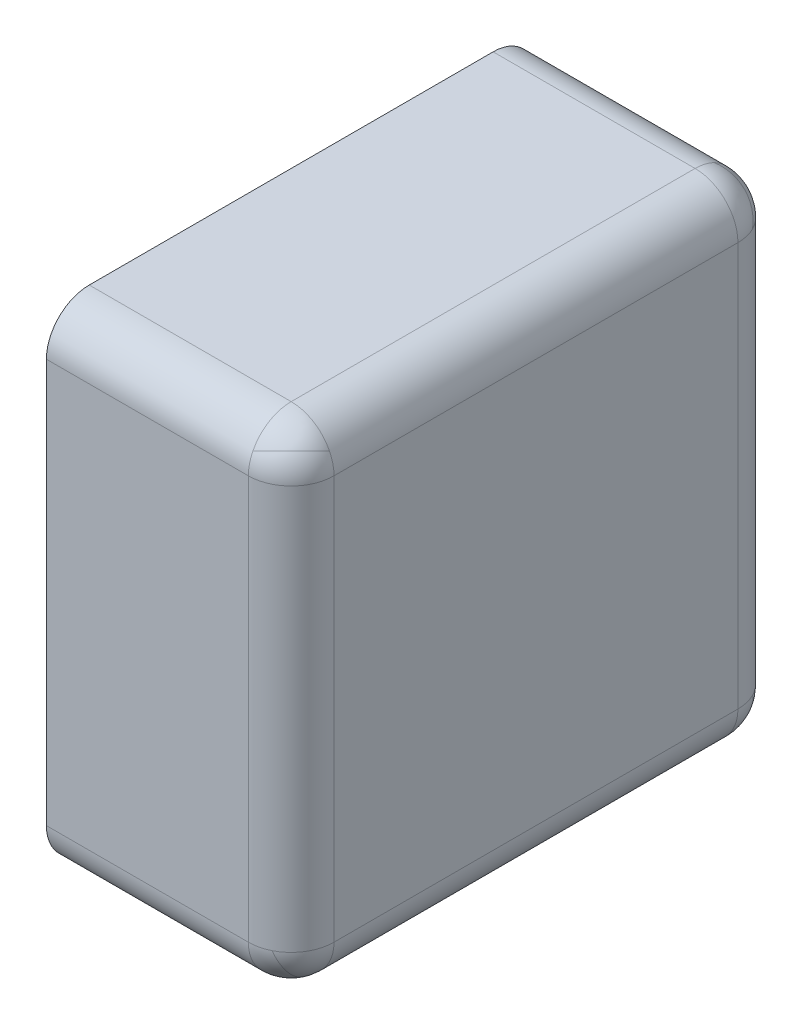
ISO-10303-21;
HEADER;
FILE_DESCRIPTION(('STEP AP214'),'2;1');
FILE_NAME('part.step','',(''),(''),'','','');
FILE_SCHEMA(('AUTOMOTIVE_DESIGN { 1 0 10303 214 1 1 1 1 }'));
ENDSEC;
DATA;
#1=APPLICATION_CONTEXT('core data for automotive mechanical design processes');
#2=APPLICATION_PROTOCOL_DEFINITION('international standard','automotive_design',2000,#1);
#3=PRODUCT_CONTEXT('',#1,'mechanical');
#4=PRODUCT('Part','Part','',(#3));
#5=PRODUCT_RELATED_PRODUCT_CATEGORY('part','',(#4));
#6=PRODUCT_DEFINITION_FORMATION('','',#4);
#7=PRODUCT_DEFINITION_CONTEXT('part definition',#1,'design');
#8=PRODUCT_DEFINITION('design','',#6,#7);
#9=PRODUCT_DEFINITION_SHAPE('','',#8);
#10=(LENGTH_UNIT() NAMED_UNIT(*) SI_UNIT(.MILLI.,.METRE.));
#11=(NAMED_UNIT(*) PLANE_ANGLE_UNIT() SI_UNIT($,.RADIAN.));
#12=(NAMED_UNIT(*) SI_UNIT($,.STERADIAN.) SOLID_ANGLE_UNIT());
#13=UNCERTAINTY_MEASURE_WITH_UNIT(LENGTH_MEASURE(1.E-05),#10,'distance_accuracy_value','');
#14=(GEOMETRIC_REPRESENTATION_CONTEXT(3) GLOBAL_UNCERTAINTY_ASSIGNED_CONTEXT((#13)) GLOBAL_UNIT_ASSIGNED_CONTEXT((#10,
#11,#12)) REPRESENTATION_CONTEXT('',''));
#15=CARTESIAN_POINT('',(0.,0.,0.));
#16=DIRECTION('',(0.,0.,1.));
#17=DIRECTION('',(1.,0.,0.));
#18=AXIS2_PLACEMENT_3D('',#15,#16,#17);
#19=CARTESIAN_POINT('',(0.770414518843274,0.370414518843274,0.0295854811567261));
#20=CARTESIAN_POINT('',(0.770414518843274,0.370414518843274,0.029585481156726));
#21=CARTESIAN_POINT('',(0.770414518843274,0.370414518843274,0.0295854811567262));
#22=CARTESIAN_POINT('',(0.770414518843274,0.370414518843274,0.0295854811567262));
#23=CARTESIAN_POINT('',(0.753915602470369,0.386913435216178,0.029585481156726));
#24=CARTESIAN_POINT('',(0.772966910088836,0.405964742834646,0.0676880963936607));
#25=CARTESIAN_POINT('',(0.805964742834645,0.372966910088837,0.0676880963936606));
#26=CARTESIAN_POINT('',(0.786913435216178,0.353915602470369,0.0295854811567262));
#27=CARTESIAN_POINT('',(0.733058110300326,0.395316860626127,0.0358125145367732));
#28=CARTESIAN_POINT('',(0.769003216560337,0.431261966886138,0.107702727056795));
#29=CARTESIAN_POINT('',(0.831261966886138,0.369003216560337,0.107702727056795));
#30=CARTESIAN_POINT('',(0.795316860626127,0.333058110300326,0.0358125145367733));
#31=CARTESIAN_POINT('',(0.71256615130185,0.393721464748298,0.0468561919749261));
#32=CARTESIAN_POINT('',(0.759421193366325,0.440576506812773,0.140566276103877));
#33=CARTESIAN_POINT('',(0.840576506812773,0.359421193366325,0.140566276103877));
#34=CARTESIAN_POINT('',(0.793721464748298,0.31256615130185,0.0468561919749263));
#35=(BOUNDED_SURFACE() B_SPLINE_SURFACE(3,3,((#19,#20,#21,#22),(#23,#24,#25,#26),(#27,#28,#29,
#30),(#31,#32,#33,#34)),.UNSPECIFIED.,.F.,.F.,.F.) B_SPLINE_SURFACE_WITH_KNOTS((4,4),(4,4),(0.,
1.),(0.,1.),.UNSPECIFIED.) GEOMETRIC_REPRESENTATION_ITEM() RATIONAL_B_SPLINE_SURFACE(((1.,
0.333333333333332,0.333333333333332,1.),(0.924501806030638,0.308167268676878,0.308167268676878,
0.924501806030638),(0.924501806030638,0.308167268676878,0.308167268676878,0.924501806030638),
(1.,0.333333333333332,0.333333333333332,1.))) REPRESENTATION_ITEM('') SURFACE());
#36=CARTESIAN_POINT('',(0.73,0.33,0.07));
#37=DIRECTION('',(-0.408248290463863,-0.408248290463863,-0.816496580927726));
#38=DIRECTION('',(0.577350269189626,0.577350269189626,-0.577350269189626));
#39=AXIS2_PLACEMENT_3D('',#36,#37,#38);
#40=CIRCLE('',#39,0.07);
#41=CARTESIAN_POINT('',(0.770414518843274,0.370414518843274,0.0295854811567262));
#42=VERTEX_POINT('',#41);
#43=CARTESIAN_POINT('',(0.792609903369994,0.33,0.0386950483150029));
#44=VERTEX_POINT('',#43);
#45=EDGE_CURVE('E11',#42,#44,#40,.T.);
#46=CARTESIAN_POINT('',(0.73,0.33,0.07));
#47=DIRECTION('',(0.408248290463863,0.408248290463863,0.816496580927726));
#48=DIRECTION('',(0.577350269189626,0.577350269189625,-0.577350269189626));
#49=AXIS2_PLACEMENT_3D('',#46,#47,#48);
#50=CIRCLE('',#49,0.0700000000000001);
#51=CARTESIAN_POINT('',(0.73,0.392609903369994,0.0386950483150029));
#52=VERTEX_POINT('',#51);
#53=EDGE_CURVE('E26',#42,#52,#50,.T.);
#54=CARTESIAN_POINT('',(0.73,0.33,0.07));
#55=DIRECTION('',(-1.,0.,0.));
#56=DIRECTION('',(0.,-1.,0.));
#57=AXIS2_PLACEMENT_3D('',#54,#55,#56);
#58=CIRCLE('',#57,0.07);
#59=CARTESIAN_POINT('',(0.73,0.4,0.07));
#60=VERTEX_POINT('',#59);
#61=EDGE_CURVE('E274',#60,#52,#58,.T.);
#62=CARTESIAN_POINT('',(0.73,0.33,0.07));
#63=DIRECTION('',(0.,0.,-1.));
#64=DIRECTION('',(1.,0.,0.));
#65=AXIS2_PLACEMENT_3D('',#62,#63,#64);
#66=CIRCLE('',#65,0.07);
#67=CARTESIAN_POINT('',(0.8,0.33,0.07));
#68=VERTEX_POINT('',#67);
#69=EDGE_CURVE('E272',#60,#68,#66,.T.);
#70=CARTESIAN_POINT('',(0.73,0.33,0.07));
#71=DIRECTION('',(0.,-1.,0.));
#72=DIRECTION('',(0.,0.,1.));
#73=AXIS2_PLACEMENT_3D('',#70,#71,#72);
#74=CIRCLE('',#73,0.07);
#75=EDGE_CURVE('E269',#44,#68,#74,.T.);
#76=ORIENTED_EDGE('',*,*,#45,.F.);
#77=ORIENTED_EDGE('',*,*,#53,.T.);
#78=ORIENTED_EDGE('',*,*,#61,.F.);
#79=ORIENTED_EDGE('',*,*,#69,.T.);
#80=ORIENTED_EDGE('',*,*,#75,.F.);
#81=EDGE_LOOP('',(#76,#77,#78,#79,#80));
#82=FACE_BOUND('',#81,.T.);
#83=ADVANCED_FACE('F17',(#82),#35,.T.);
#84=CARTESIAN_POINT('',(0.770414518843273,0.370414518843273,0.770414518843273));
#85=CARTESIAN_POINT('',(0.770414518843273,0.370414518843273,0.770414518843273));
#86=CARTESIAN_POINT('',(0.770414518843273,0.370414518843273,0.770414518843273));
#87=CARTESIAN_POINT('',(0.770414518843273,0.370414518843273,0.770414518843273));
#88=CARTESIAN_POINT('',(0.786913435216178,0.370414518843273,0.753915602470369));
#89=CARTESIAN_POINT('',(0.767862127597711,0.408517134080208,0.734864294851902));
#90=CARTESIAN_POINT('',(0.734864294851902,0.408517134080208,0.767862127597711));
#91=CARTESIAN_POINT('',(0.753915602470369,0.370414518843273,0.786913435216178));
#92=CARTESIAN_POINT('',(0.795316860626127,0.364187485463226,0.733058110300326));
#93=CARTESIAN_POINT('',(0.759371754366116,0.436077697983248,0.697113004040315));
#94=CARTESIAN_POINT('',(0.697113004040315,0.436077697983248,0.759371754366116));
#95=CARTESIAN_POINT('',(0.733058110300326,0.364187485463226,0.795316860626127));
#96=CARTESIAN_POINT('',(0.793721464748297,0.353143808025074,0.71256615130185));
#97=CARTESIAN_POINT('',(0.746866422683822,0.446853892154024,0.665711109237375));
#98=CARTESIAN_POINT('',(0.665711109237374,0.446853892154023,0.746866422683823));
#99=CARTESIAN_POINT('',(0.712566151301849,0.353143808025073,0.793721464748297));
#100=(BOUNDED_SURFACE() B_SPLINE_SURFACE(3,3,((#84,#85,#86,#87),(#88,#89,#90,#91),(#92,#93,#94,
#95),(#96,#97,#98,#99)),.UNSPECIFIED.,.F.,.F.,.F.) B_SPLINE_SURFACE_WITH_KNOTS((4,4),(4,4),(0.,
1.),(0.,1.),.UNSPECIFIED.) GEOMETRIC_REPRESENTATION_ITEM() RATIONAL_B_SPLINE_SURFACE(((1.,
0.333333333333333,0.333333333333333,1.),(0.924501806030638,0.308167268676879,0.308167268676879,
0.924501806030638),(0.924501806030638,0.308167268676879,0.308167268676879,0.924501806030638),
(1.,0.333333333333333,0.333333333333333,1.))) REPRESENTATION_ITEM('') SURFACE());
#101=CARTESIAN_POINT('',(0.73,0.33,0.73));
#102=DIRECTION('',(0.408248290463863,-0.816496580927726,0.408248290463863));
#103=DIRECTION('',(0.577350269189626,0.577350269189625,0.577350269189626));
#104=AXIS2_PLACEMENT_3D('',#101,#102,#103);
#105=CIRCLE('',#104,0.07);
#106=CARTESIAN_POINT('',(0.770414518843274,0.370414518843274,0.770414518843274));
#107=VERTEX_POINT('',#106);
#108=CARTESIAN_POINT('',(0.73,0.361304951684997,0.792609903369994));
#109=VERTEX_POINT('',#108);
#110=EDGE_CURVE('E267',#107,#109,#105,.T.);
#111=CARTESIAN_POINT('',(0.73,0.33,0.73));
#112=DIRECTION('',(-0.408248290463862,0.816496580927727,-0.408248290463863));
#113=DIRECTION('',(0.577350269189626,0.577350269189625,0.577350269189626));
#114=AXIS2_PLACEMENT_3D('',#111,#112,#113);
#115=CIRCLE('',#114,0.0699999999999999);
#116=CARTESIAN_POINT('',(0.792609903369994,0.361304951684997,0.73));
#117=VERTEX_POINT('',#116);
#118=EDGE_CURVE('E265',#107,#117,#115,.T.);
#119=CARTESIAN_POINT('',(0.73,0.33,0.73));
#120=DIRECTION('',(0.,0.,-1.));
#121=DIRECTION('',(1.,0.,0.));
#122=AXIS2_PLACEMENT_3D('',#119,#120,#121);
#123=CIRCLE('',#122,0.07);
#124=CARTESIAN_POINT('',(0.73,0.4,0.73));
#125=VERTEX_POINT('',#124);
#126=EDGE_CURVE('E134',#125,#117,#123,.T.);
#127=CARTESIAN_POINT('',(0.73,0.33,0.73));
#128=DIRECTION('',(-1.,0.,0.));
#129=DIRECTION('',(0.,-1.,0.));
#130=AXIS2_PLACEMENT_3D('',#127,#128,#129);
#131=CIRCLE('',#130,0.07);
#132=EDGE_CURVE('E261',#109,#125,#131,.T.);
#133=ORIENTED_EDGE('',*,*,#110,.F.);
#134=ORIENTED_EDGE('',*,*,#118,.T.);
#135=ORIENTED_EDGE('',*,*,#126,.F.);
#136=ORIENTED_EDGE('',*,*,#132,.F.);
#137=EDGE_LOOP('',(#133,#134,#135,#136));
#138=FACE_BOUND('',#137,.T.);
#139=ADVANCED_FACE('F339',(#138),#100,.T.);
#140=CARTESIAN_POINT('',(0.770414518843274,-0.370414518843274,0.770414518843274));
#141=CARTESIAN_POINT('',(0.770414518843274,-0.370414518843273,0.770414518843274));
#142=CARTESIAN_POINT('',(0.770414518843273,-0.370414518843273,0.770414518843274));
#143=CARTESIAN_POINT('',(0.770414518843273,-0.370414518843273,0.770414518843274));
#144=CARTESIAN_POINT('',(0.770414518843274,-0.386913435216178,0.753915602470369));
#145=CARTESIAN_POINT('',(0.808517134080209,-0.367862127597711,0.734864294851902));
#146=CARTESIAN_POINT('',(0.808517134080207,-0.334864294851901,0.767862127597711));
#147=CARTESIAN_POINT('',(0.770414518843273,-0.353915602470369,0.786913435216178));
#148=CARTESIAN_POINT('',(0.764187485463226,-0.395316860626127,0.733058110300326));
#149=CARTESIAN_POINT('',(0.836077697983248,-0.359371754366116,0.697113004040316));
#150=CARTESIAN_POINT('',(0.836077697983248,-0.297113004040315,0.759371754366117));
#151=CARTESIAN_POINT('',(0.764187485463226,-0.333058110300326,0.795316860626127));
#152=CARTESIAN_POINT('',(0.753143808025074,-0.393721464748297,0.71256615130185));
#153=CARTESIAN_POINT('',(0.846853892154024,-0.346866422683822,0.665711109237375));
#154=CARTESIAN_POINT('',(0.846853892154024,-0.265711109237374,0.746866422683823));
#155=CARTESIAN_POINT('',(0.753143808025073,-0.31256615130185,0.793721464748298));
#156=(BOUNDED_SURFACE() B_SPLINE_SURFACE(3,3,((#140,#141,#142,#143),(#144,#145,#146,#147),(#148,
#149,#150,#151),(#152,#153,#154,#155)),.UNSPECIFIED.,.F.,.F.,
.F.) B_SPLINE_SURFACE_WITH_KNOTS((4,4),(4,4),(0.,1.),(0.,1.),
.UNSPECIFIED.) GEOMETRIC_REPRESENTATION_ITEM() RATIONAL_B_SPLINE_SURFACE(((1.,0.333333333333333,
0.333333333333333,1.),(0.924501806030638,0.308167268676879,0.308167268676879,0.924501806030638),
(0.924501806030638,0.308167268676879,0.308167268676879,0.924501806030638),(1.,0.333333333333333,
0.333333333333333,1.))) REPRESENTATION_ITEM('') SURFACE());
#157=CARTESIAN_POINT('',(0.73,-0.33,0.73));
#158=DIRECTION('',(-0.816496580927726,-0.408248290463863,0.408248290463862));
#159=DIRECTION('',(0.577350269189625,-0.577350269189625,0.577350269189627));
#160=AXIS2_PLACEMENT_3D('',#157,#158,#159);
#161=CIRCLE('',#160,0.07);
#162=CARTESIAN_POINT('',(0.770414518843274,-0.370414518843274,0.770414518843274));
#163=VERTEX_POINT('',#162);
#164=CARTESIAN_POINT('',(0.761304951684997,-0.33,0.792609903369994));
#165=VERTEX_POINT('',#164);
#166=EDGE_CURVE('E259',#163,#165,#161,.T.);
#167=CARTESIAN_POINT('',(0.73,-0.33,0.73));
#168=DIRECTION('',(0.816496580927727,0.408248290463863,-0.408248290463862));
#169=DIRECTION('',(0.577350269189625,-0.577350269189627,0.577350269189625));
#170=AXIS2_PLACEMENT_3D('',#167,#168,#169);
#171=CIRCLE('',#170,0.0699999999999999);
#172=CARTESIAN_POINT('',(0.761304951684997,-0.392609903369994,0.73));
#173=VERTEX_POINT('',#172);
#174=EDGE_CURVE('E257',#163,#173,#171,.T.);
#175=CARTESIAN_POINT('',(0.73,-0.33,0.73));
#176=DIRECTION('',(0.,0.,1.));
#177=DIRECTION('',(1.,0.,0.));
#178=AXIS2_PLACEMENT_3D('',#175,#176,#177);
#179=CIRCLE('',#178,0.07);
#180=CARTESIAN_POINT('',(0.8,-0.33,0.73));
#181=VERTEX_POINT('',#180);
#182=EDGE_CURVE('E255',#173,#181,#179,.T.);
#183=CARTESIAN_POINT('',(0.73,-0.33,0.73));
#184=DIRECTION('',(0.,1.,0.));
#185=DIRECTION('',(0.,0.,1.));
#186=AXIS2_PLACEMENT_3D('',#183,#184,#185);
#187=CIRCLE('',#186,0.07);
#188=EDGE_CURVE('E164',#165,#181,#187,.T.);
#189=ORIENTED_EDGE('',*,*,#166,.F.);
#190=ORIENTED_EDGE('',*,*,#174,.T.);
#191=ORIENTED_EDGE('',*,*,#182,.T.);
#192=ORIENTED_EDGE('',*,*,#188,.F.);
#193=EDGE_LOOP('',(#189,#190,#191,#192));
#194=FACE_BOUND('',#193,.T.);
#195=ADVANCED_FACE('F343',(#194),#156,.T.);
#196=CARTESIAN_POINT('',(0.770414518843274,-0.370414518843274,0.029585481156726));
#197=CARTESIAN_POINT('',(0.770414518843274,-0.370414518843273,0.0295854811567259));
#198=CARTESIAN_POINT('',(0.770414518843274,-0.370414518843274,0.0295854811567262));
#199=CARTESIAN_POINT('',(0.770414518843274,-0.370414518843274,0.0295854811567261));
#200=CARTESIAN_POINT('',(0.786913435216178,-0.353915602470369,0.029585481156726));
#201=CARTESIAN_POINT('',(0.805964742834646,-0.372966910088836,0.0676880963936607));
#202=CARTESIAN_POINT('',(0.772966910088837,-0.405964742834646,0.0676880963936608));
#203=CARTESIAN_POINT('',(0.753915602470369,-0.386913435216179,0.0295854811567261));
#204=CARTESIAN_POINT('',(0.795316860626127,-0.333058110300326,0.0358125145367732));
#205=CARTESIAN_POINT('',(0.831261966886138,-0.369003216560336,0.107702727056795));
#206=CARTESIAN_POINT('',(0.769003216560337,-0.431261966886138,0.107702727056796));
#207=CARTESIAN_POINT('',(0.733058110300326,-0.395316860626127,0.0358125145367734));
#208=CARTESIAN_POINT('',(0.793721464748298,-0.312566151301849,0.0468561919749261));
#209=CARTESIAN_POINT('',(0.840576506812774,-0.359421193366324,0.140566276103877));
#210=CARTESIAN_POINT('',(0.759421193366325,-0.440576506812773,0.140566276103877));
#211=CARTESIAN_POINT('',(0.71256615130185,-0.393721464748298,0.0468561919749264));
#212=(BOUNDED_SURFACE() B_SPLINE_SURFACE(3,3,((#196,#197,#198,#199),(#200,#201,#202,#203),(#204,
#205,#206,#207),(#208,#209,#210,#211)),.UNSPECIFIED.,.F.,.F.,
.F.) B_SPLINE_SURFACE_WITH_KNOTS((4,4),(4,4),(0.,1.),(0.,1.),
.UNSPECIFIED.) GEOMETRIC_REPRESENTATION_ITEM() RATIONAL_B_SPLINE_SURFACE(((1.,0.333333333333333,
0.333333333333333,1.),(0.924501806030637,0.308167268676879,0.308167268676879,0.924501806030637),
(0.924501806030637,0.308167268676879,0.308167268676879,0.924501806030637),(1.,0.333333333333333,
0.333333333333333,1.))) REPRESENTATION_ITEM('') SURFACE());
#213=CARTESIAN_POINT('',(0.73,-0.33,0.07));
#214=DIRECTION('',(-0.408248290463864,0.408248290463862,-0.816496580927726));
#215=DIRECTION('',(0.577350269189627,-0.577350269189624,-0.577350269189626));
#216=AXIS2_PLACEMENT_3D('',#213,#214,#215);
#217=CIRCLE('',#216,0.07);
#218=CARTESIAN_POINT('',(0.770414518843274,-0.370414518843274,0.0295854811567262));
#219=VERTEX_POINT('',#218);
#220=CARTESIAN_POINT('',(0.73,-0.392609903369994,0.038695048315003));
#221=VERTEX_POINT('',#220);
#222=EDGE_CURVE('E252',#219,#221,#217,.T.);
#223=CARTESIAN_POINT('',(0.73,-0.33,0.07));
#224=DIRECTION('',(0.408248290463864,-0.408248290463862,0.816496580927726));
#225=DIRECTION('',(0.577350269189627,-0.577350269189625,-0.577350269189626));
#226=AXIS2_PLACEMENT_3D('',#223,#224,#225);
#227=CIRCLE('',#226,0.0700000000000001);
#228=CARTESIAN_POINT('',(0.792609903369994,-0.33,0.0386950483150029));
#229=VERTEX_POINT('',#228);
#230=EDGE_CURVE('E250',#219,#229,#227,.T.);
#231=CARTESIAN_POINT('',(0.73,-0.33,0.07));
#232=DIRECTION('',(0.,1.,0.));
#233=DIRECTION('',(0.,0.,1.));
#234=AXIS2_PLACEMENT_3D('',#231,#232,#233);
#235=CIRCLE('',#234,0.07);
#236=CARTESIAN_POINT('',(0.8,-0.33,0.07));
#237=VERTEX_POINT('',#236);
#238=EDGE_CURVE('E247',#237,#229,#235,.T.);
#239=CARTESIAN_POINT('',(0.73,-0.33,0.07));
#240=DIRECTION('',(0.,0.,1.));
#241=DIRECTION('',(1.,0.,0.));
#242=AXIS2_PLACEMENT_3D('',#239,#240,#241);
#243=CIRCLE('',#242,0.07);
#244=CARTESIAN_POINT('',(0.73,-0.4,0.07));
#245=VERTEX_POINT('',#244);
#246=EDGE_CURVE('E244',#245,#237,#243,.T.);
#247=CARTESIAN_POINT('',(0.73,-0.33,0.07));
#248=DIRECTION('',(-1.,0.,0.));
#249=DIRECTION('',(0.,0.,-1.));
#250=AXIS2_PLACEMENT_3D('',#247,#248,#249);
#251=CIRCLE('',#250,0.07);
#252=EDGE_CURVE('E241',#221,#245,#251,.T.);
#253=ORIENTED_EDGE('',*,*,#222,.F.);
#254=ORIENTED_EDGE('',*,*,#230,.T.);
#255=ORIENTED_EDGE('',*,*,#238,.F.);
#256=ORIENTED_EDGE('',*,*,#246,.F.);
#257=ORIENTED_EDGE('',*,*,#252,.F.);
#258=EDGE_LOOP('',(#253,#254,#255,#256,#257));
#259=FACE_BOUND('',#258,.T.);
#260=ADVANCED_FACE('F298',(#259),#212,.T.);
#261=CARTESIAN_POINT('',(0.4,0.4,0.));
#262=DIRECTION('',(-1.,0.,0.));
#263=DIRECTION('',(0.,-1.,0.));
#264=AXIS2_PLACEMENT_3D('',#261,#262,#263);
#265=PLANE('',#264);
#266=CARTESIAN_POINT('',(0.4,0.33,0.07));
#267=DIRECTION('',(-1.,0.,0.));
#268=DIRECTION('',(0.,-1.,0.));
#269=AXIS2_PLACEMENT_3D('',#266,#267,#268);
#270=CIRCLE('',#269,0.07);
#271=CARTESIAN_POINT('',(0.4,0.4,0.07));
#272=VERTEX_POINT('',#271);
#273=CARTESIAN_POINT('',(0.4,0.33,0.));
#274=VERTEX_POINT('',#273);
#275=EDGE_CURVE('E239',#272,#274,#270,.T.);
#276=ORIENTED_EDGE('',*,*,#275,.T.);
#277=DIRECTION('',(0.,-1.,0.));
#278=VECTOR('',#277,1.);
#279=CARTESIAN_POINT('',(0.4,0.4,0.));
#280=LINE('',#279,#278);
#281=CARTESIAN_POINT('',(0.4,-0.33,0.));
#282=VERTEX_POINT('',#281);
#283=EDGE_CURVE('E237',#274,#282,#280,.T.);
#284=ORIENTED_EDGE('',*,*,#283,.T.);
#285=CARTESIAN_POINT('',(0.4,-0.33,0.07));
#286=DIRECTION('',(-1.,0.,0.));
#287=DIRECTION('',(0.,0.,-1.));
#288=AXIS2_PLACEMENT_3D('',#285,#286,#287);
#289=CIRCLE('',#288,0.07);
#290=CARTESIAN_POINT('',(0.4,-0.4,0.07));
#291=VERTEX_POINT('',#290);
#292=EDGE_CURVE('E235',#282,#291,#289,.T.);
#293=ORIENTED_EDGE('',*,*,#292,.T.);
#294=DIRECTION('',(0.,0.,1.));
#295=VECTOR('',#294,1.);
#296=CARTESIAN_POINT('',(0.4,-0.4,0.));
#297=LINE('',#296,#295);
#298=CARTESIAN_POINT('',(0.4,-0.4,0.73));
#299=VERTEX_POINT('',#298);
#300=EDGE_CURVE('E233',#291,#299,#297,.T.);
#301=ORIENTED_EDGE('',*,*,#300,.T.);
#302=CARTESIAN_POINT('',(0.4,-0.33,0.73));
#303=DIRECTION('',(-1.,0.,0.));
#304=DIRECTION('',(0.,0.,-1.));
#305=AXIS2_PLACEMENT_3D('',#302,#303,#304);
#306=CIRCLE('',#305,0.07);
#307=CARTESIAN_POINT('',(0.4,-0.33,0.8));
#308=VERTEX_POINT('',#307);
#309=EDGE_CURVE('E231',#299,#308,#306,.T.);
#310=ORIENTED_EDGE('',*,*,#309,.T.);
#311=DIRECTION('',(0.,1.,0.));
#312=VECTOR('',#311,1.);
#313=CARTESIAN_POINT('',(0.4,0.4,0.8));
#314=LINE('',#313,#312);
#315=CARTESIAN_POINT('',(0.4,0.33,0.8));
#316=VERTEX_POINT('',#315);
#317=EDGE_CURVE('E229',#308,#316,#314,.T.);
#318=ORIENTED_EDGE('',*,*,#317,.T.);
#319=CARTESIAN_POINT('',(0.4,0.33,0.73));
#320=DIRECTION('',(-1.,0.,0.));
#321=DIRECTION('',(0.,-1.,0.));
#322=AXIS2_PLACEMENT_3D('',#319,#320,#321);
#323=CIRCLE('',#322,0.07);
#324=CARTESIAN_POINT('',(0.4,0.4,0.73));
#325=VERTEX_POINT('',#324);
#326=EDGE_CURVE('E227',#316,#325,#323,.T.);
#327=ORIENTED_EDGE('',*,*,#326,.T.);
#328=DIRECTION('',(0.,0.,-1.));
#329=VECTOR('',#328,1.);
#330=CARTESIAN_POINT('',(0.4,0.4,0.));
#331=LINE('',#330,#329);
#332=EDGE_CURVE('E224',#325,#272,#331,.T.);
#333=ORIENTED_EDGE('',*,*,#332,.T.);
#334=EDGE_LOOP('',(#276,#284,#293,#301,#310,#318,#327,#333));
#335=FACE_BOUND('',#334,.T.);
#336=ADVANCED_FACE('F318',(#335),#265,.T.);
#337=CARTESIAN_POINT('',(0.6,0.,0.));
#338=DIRECTION('',(0.,0.,1.));
#339=DIRECTION('',(1.,0.,0.));
#340=AXIS2_PLACEMENT_3D('',#337,#338,#339);
#341=PLANE('',#340);
#342=ORIENTED_EDGE('',*,*,#283,.F.);
#343=DIRECTION('',(-1.,0.,0.));
#344=VECTOR('',#343,1.);
#345=CARTESIAN_POINT('',(0.6,0.33,0.));
#346=LINE('',#345,#344);
#347=CARTESIAN_POINT('',(0.73,0.33,0.));
#348=VERTEX_POINT('',#347);
#349=EDGE_CURVE('E221',#348,#274,#346,.T.);
#350=ORIENTED_EDGE('',*,*,#349,.F.);
#351=DIRECTION('',(0.,1.,0.));
#352=VECTOR('',#351,1.);
#353=CARTESIAN_POINT('',(0.73,0.,0.));
#354=LINE('',#353,#352);
#355=CARTESIAN_POINT('',(0.73,-0.33,0.));
#356=VERTEX_POINT('',#355);
#357=EDGE_CURVE('E218',#356,#348,#354,.T.);
#358=ORIENTED_EDGE('',*,*,#357,.F.);
#359=DIRECTION('',(1.,0.,0.));
#360=VECTOR('',#359,1.);
#361=CARTESIAN_POINT('',(0.6,-0.33,0.));
#362=LINE('',#361,#360);
#363=EDGE_CURVE('E215',#282,#356,#362,.T.);
#364=ORIENTED_EDGE('',*,*,#363,.F.);
#365=EDGE_LOOP('',(#342,#350,#358,#364));
#366=FACE_BOUND('',#365,.T.);
#367=ADVANCED_FACE('F287',(#366),#341,.F.);
#368=CARTESIAN_POINT('',(0.7,0.33,0.07));
#369=DIRECTION('',(-1.,0.,0.));
#370=DIRECTION('',(0.,-1.,0.));
#371=AXIS2_PLACEMENT_3D('',#368,#369,#370);
#372=CYLINDRICAL_SURFACE('',#371,0.07);
#373=ORIENTED_EDGE('',*,*,#61,.T.);
#374=CARTESIAN_POINT('',(0.73,0.33,0.07));
#375=DIRECTION('',(-1.,0.,0.));
#376=DIRECTION('',(0.,-1.,0.));
#377=AXIS2_PLACEMENT_3D('',#374,#375,#376);
#378=CIRCLE('',#377,0.07);
#379=EDGE_CURVE('E212',#52,#348,#378,.T.);
#380=ORIENTED_EDGE('',*,*,#379,.T.);
#381=ORIENTED_EDGE('',*,*,#349,.T.);
#382=ORIENTED_EDGE('',*,*,#275,.F.);
#383=DIRECTION('',(1.,0.,0.));
#384=VECTOR('',#383,1.);
#385=CARTESIAN_POINT('',(0.7,0.4,0.07));
#386=LINE('',#385,#384);
#387=EDGE_CURVE('E209',#272,#60,#386,.T.);
#388=ORIENTED_EDGE('',*,*,#387,.T.);
#389=EDGE_LOOP('',(#373,#380,#381,#382,#388));
#390=FACE_BOUND('',#389,.T.);
#391=ADVANCED_FACE('F278',(#390),#372,.T.);
#392=CARTESIAN_POINT('',(0.8,0.4,0.));
#393=DIRECTION('',(0.,1.,0.));
#394=DIRECTION('',(-1.,0.,0.));
#395=AXIS2_PLACEMENT_3D('',#392,#393,#394);
#396=PLANE('',#395);
#397=DIRECTION('',(1.,0.,0.));
#398=VECTOR('',#397,1.);
#399=CARTESIAN_POINT('',(0.8,0.4,0.73));
#400=LINE('',#399,#398);
#401=EDGE_CURVE('E206',#325,#125,#400,.T.);
#402=ORIENTED_EDGE('',*,*,#401,.T.);
#403=DIRECTION('',(0.,0.,-1.));
#404=VECTOR('',#403,1.);
#405=CARTESIAN_POINT('',(0.73,0.4,0.));
#406=LINE('',#405,#404);
#407=EDGE_CURVE('E203',#125,#60,#406,.T.);
#408=ORIENTED_EDGE('',*,*,#407,.T.);
#409=ORIENTED_EDGE('',*,*,#387,.F.);
#410=ORIENTED_EDGE('',*,*,#332,.F.);
#411=EDGE_LOOP('',(#402,#408,#409,#410));
#412=FACE_BOUND('',#411,.T.);
#413=ADVANCED_FACE('F328',(#412),#396,.T.);
#414=CARTESIAN_POINT('',(0.7,0.33,0.73));
#415=DIRECTION('',(-1.,0.,0.));
#416=DIRECTION('',(0.,-1.,0.));
#417=AXIS2_PLACEMENT_3D('',#414,#415,#416);
#418=CYLINDRICAL_SURFACE('',#417,0.07);
#419=CARTESIAN_POINT('',(0.73,0.33,0.73));
#420=DIRECTION('',(-1.,0.,0.));
#421=DIRECTION('',(0.,-1.,0.));
#422=AXIS2_PLACEMENT_3D('',#419,#420,#421);
#423=CIRCLE('',#422,0.07);
#424=CARTESIAN_POINT('',(0.73,0.33,0.8));
#425=VERTEX_POINT('',#424);
#426=EDGE_CURVE('E154',#425,#109,#423,.T.);
#427=ORIENTED_EDGE('',*,*,#426,.T.);
#428=ORIENTED_EDGE('',*,*,#132,.T.);
#429=ORIENTED_EDGE('',*,*,#401,.F.);
#430=ORIENTED_EDGE('',*,*,#326,.F.);
#431=DIRECTION('',(1.,0.,0.));
#432=VECTOR('',#431,1.);
#433=CARTESIAN_POINT('',(0.7,0.33,0.8));
#434=LINE('',#433,#432);
#435=EDGE_CURVE('E200',#316,#425,#434,.T.);
#436=ORIENTED_EDGE('',*,*,#435,.T.);
#437=EDGE_LOOP('',(#427,#428,#429,#430,#436));
#438=FACE_BOUND('',#437,.T.);
#439=ADVANCED_FACE('F324',(#438),#418,.T.);
#440=CARTESIAN_POINT('',(0.6,0.,0.8));
#441=DIRECTION('',(0.,0.,1.));
#442=DIRECTION('',(1.,0.,0.));
#443=AXIS2_PLACEMENT_3D('',#440,#441,#442);
#444=PLANE('',#443);
#445=ORIENTED_EDGE('',*,*,#435,.F.);
#446=ORIENTED_EDGE('',*,*,#317,.F.);
#447=DIRECTION('',(1.,0.,0.));
#448=VECTOR('',#447,1.);
#449=CARTESIAN_POINT('',(0.6,-0.33,0.8));
#450=LINE('',#449,#448);
#451=CARTESIAN_POINT('',(0.73,-0.33,0.8));
#452=VERTEX_POINT('',#451);
#453=EDGE_CURVE('E198',#308,#452,#450,.T.);
#454=ORIENTED_EDGE('',*,*,#453,.T.);
#455=DIRECTION('',(0.,1.,0.));
#456=VECTOR('',#455,1.);
#457=CARTESIAN_POINT('',(0.73,0.,0.8));
#458=LINE('',#457,#456);
#459=EDGE_CURVE('E195',#452,#425,#458,.T.);
#460=ORIENTED_EDGE('',*,*,#459,.T.);
#461=EDGE_LOOP('',(#445,#446,#454,#460));
#462=FACE_BOUND('',#461,.T.);
#463=ADVANCED_FACE('F322',(#462),#444,.T.);
#464=CARTESIAN_POINT('',(0.5,-0.33,0.73));
#465=DIRECTION('',(1.,0.,0.));
#466=DIRECTION('',(0.,0.,-1.));
#467=AXIS2_PLACEMENT_3D('',#464,#465,#466);
#468=CYLINDRICAL_SURFACE('',#467,0.07);
#469=CARTESIAN_POINT('',(0.73,-0.33,0.73));
#470=DIRECTION('',(-1.,0.,0.));
#471=DIRECTION('',(0.,0.,-1.));
#472=AXIS2_PLACEMENT_3D('',#469,#470,#471);
#473=CIRCLE('',#472,0.07);
#474=CARTESIAN_POINT('',(0.73,-0.4,0.73));
#475=VERTEX_POINT('',#474);
#476=EDGE_CURVE('E192',#475,#452,#473,.T.);
#477=ORIENTED_EDGE('',*,*,#476,.T.);
#478=ORIENTED_EDGE('',*,*,#453,.F.);
#479=ORIENTED_EDGE('',*,*,#309,.F.);
#480=DIRECTION('',(1.,0.,0.));
#481=VECTOR('',#480,1.);
#482=CARTESIAN_POINT('',(0.5,-0.4,0.73));
#483=LINE('',#482,#481);
#484=EDGE_CURVE('E189',#299,#475,#483,.T.);
#485=ORIENTED_EDGE('',*,*,#484,.T.);
#486=EDGE_LOOP('',(#477,#478,#479,#485));
#487=FACE_BOUND('',#486,.T.);
#488=ADVANCED_FACE('F315',(#487),#468,.T.);
#489=CARTESIAN_POINT('',(0.4,-0.4,0.));
#490=DIRECTION('',(0.,-1.,0.));
#491=DIRECTION('',(0.,0.,-1.));
#492=AXIS2_PLACEMENT_3D('',#489,#490,#491);
#493=PLANE('',#492);
#494=ORIENTED_EDGE('',*,*,#484,.F.);
#495=ORIENTED_EDGE('',*,*,#300,.F.);
#496=DIRECTION('',(1.,0.,0.));
#497=VECTOR('',#496,1.);
#498=CARTESIAN_POINT('',(0.4,-0.4,0.07));
#499=LINE('',#498,#497);
#500=EDGE_CURVE('E186',#291,#245,#499,.T.);
#501=ORIENTED_EDGE('',*,*,#500,.T.);
#502=DIRECTION('',(0.,0.,1.));
#503=VECTOR('',#502,1.);
#504=CARTESIAN_POINT('',(0.73,-0.4,0.));
#505=LINE('',#504,#503);
#506=EDGE_CURVE('E183',#245,#475,#505,.T.);
#507=ORIENTED_EDGE('',*,*,#506,.T.);
#508=EDGE_LOOP('',(#494,#495,#501,#507));
#509=FACE_BOUND('',#508,.T.);
#510=ADVANCED_FACE('F303',(#509),#493,.T.);
#511=CARTESIAN_POINT('',(0.5,-0.33,0.07));
#512=DIRECTION('',(1.,0.,0.));
#513=DIRECTION('',(0.,0.,-1.));
#514=AXIS2_PLACEMENT_3D('',#511,#512,#513);
#515=CYLINDRICAL_SURFACE('',#514,0.07);
#516=CARTESIAN_POINT('',(0.73,-0.33,0.07));
#517=DIRECTION('',(-1.,0.,0.));
#518=DIRECTION('',(0.,0.,-1.));
#519=AXIS2_PLACEMENT_3D('',#516,#517,#518);
#520=CIRCLE('',#519,0.07);
#521=EDGE_CURVE('E180',#356,#221,#520,.T.);
#522=ORIENTED_EDGE('',*,*,#521,.T.);
#523=ORIENTED_EDGE('',*,*,#252,.T.);
#524=ORIENTED_EDGE('',*,*,#500,.F.);
#525=ORIENTED_EDGE('',*,*,#292,.F.);
#526=ORIENTED_EDGE('',*,*,#363,.T.);
#527=EDGE_LOOP('',(#522,#523,#524,#525,#526));
#528=FACE_BOUND('',#527,.T.);
#529=ADVANCED_FACE('F291',(#528),#515,.T.);
#530=CARTESIAN_POINT('',(0.73,-0.2,0.07));
#531=DIRECTION('',(0.,1.,0.));
#532=DIRECTION('',(0.,0.,1.));
#533=AXIS2_PLACEMENT_3D('',#530,#531,#532);
#534=CYLINDRICAL_SURFACE('',#533,0.07);
#535=ORIENTED_EDGE('',*,*,#238,.T.);
#536=CARTESIAN_POINT('',(0.73,-0.33,0.07));
#537=DIRECTION('',(0.,1.,0.));
#538=DIRECTION('',(0.,0.,1.));
#539=AXIS2_PLACEMENT_3D('',#536,#537,#538);
#540=CIRCLE('',#539,0.07);
#541=EDGE_CURVE('E177',#229,#356,#540,.T.);
#542=ORIENTED_EDGE('',*,*,#541,.T.);
#543=ORIENTED_EDGE('',*,*,#357,.T.);
#544=CARTESIAN_POINT('',(0.73,0.33,0.07));
#545=DIRECTION('',(0.,-1.,0.));
#546=DIRECTION('',(0.,0.,1.));
#547=AXIS2_PLACEMENT_3D('',#544,#545,#546);
#548=CIRCLE('',#547,0.07);
#549=EDGE_CURVE('E174',#348,#44,#548,.T.);
#550=ORIENTED_EDGE('',*,*,#549,.T.);
#551=ORIENTED_EDGE('',*,*,#75,.T.);
#552=DIRECTION('',(0.,-1.,0.));
#553=VECTOR('',#552,1.);
#554=CARTESIAN_POINT('',(0.8,-0.2,0.07));
#555=LINE('',#554,#553);
#556=EDGE_CURVE('E138',#68,#237,#555,.T.);
#557=ORIENTED_EDGE('',*,*,#556,.T.);
#558=EDGE_LOOP('',(#535,#542,#543,#550,#551,#557));
#559=FACE_BOUND('',#558,.T.);
#560=ADVANCED_FACE('F282',(#559),#534,.T.);
#561=CARTESIAN_POINT('',(0.770414518843274,0.370414518843274,0.0295854811567262));
#562=CARTESIAN_POINT('',(0.770414518843273,0.370414518843273,0.0295854811567262));
#563=CARTESIAN_POINT('',(0.770414518843273,0.370414518843274,0.0295854811567261));
#564=CARTESIAN_POINT('',(0.770414518843274,0.370414518843274,0.0295854811567263));
#565=CARTESIAN_POINT('',(0.786913435216178,0.353915602470369,0.0295854811567262));
#566=CARTESIAN_POINT('',(0.767862127597712,0.334864294851902,-0.00851713408020819));
#567=CARTESIAN_POINT('',(0.734864294851902,0.367862127597711,-0.00851713408020813));
#568=CARTESIAN_POINT('',(0.753915602470369,0.386913435216178,0.0295854811567262));
#569=CARTESIAN_POINT('',(0.795316860626127,0.333058110300326,0.0358125145367734));
#570=CARTESIAN_POINT('',(0.759371754366117,0.297113004040315,-0.0360776979832482));
#571=CARTESIAN_POINT('',(0.697113004040315,0.359371754366117,-0.0360776979832483));
#572=CARTESIAN_POINT('',(0.733058110300326,0.395316860626127,0.0358125145367733));
#573=CARTESIAN_POINT('',(0.793721464748298,0.31256615130185,0.0468561919749263));
#574=CARTESIAN_POINT('',(0.746866422683823,0.265711109237375,-0.0468538921540238));
#575=CARTESIAN_POINT('',(0.665711109237375,0.346866422683822,-0.046853892154024));
#576=CARTESIAN_POINT('',(0.71256615130185,0.393721464748298,0.0468561919749261));
#577=(BOUNDED_SURFACE() B_SPLINE_SURFACE(3,3,((#561,#562,#563,#564),(#565,#566,#567,#568),(#569,
#570,#571,#572),(#573,#574,#575,#576)),.UNSPECIFIED.,.F.,.F.,
.F.) B_SPLINE_SURFACE_WITH_KNOTS((4,4),(4,4),(0.,1.),(0.,1.),
.UNSPECIFIED.) GEOMETRIC_REPRESENTATION_ITEM() RATIONAL_B_SPLINE_SURFACE(((1.,0.333333333333334,
0.333333333333334,1.),(0.924501806030638,0.30816726867688,0.30816726867688,0.924501806030638),
(0.924501806030638,0.30816726867688,0.30816726867688,0.924501806030638),(1.,0.333333333333334,
0.333333333333334,1.))) REPRESENTATION_ITEM('') SURFACE());
#578=ORIENTED_EDGE('',*,*,#53,.F.);
#579=ORIENTED_EDGE('',*,*,#45,.T.);
#580=ORIENTED_EDGE('',*,*,#549,.F.);
#581=ORIENTED_EDGE('',*,*,#379,.F.);
#582=EDGE_LOOP('',(#578,#579,#580,#581));
#583=FACE_BOUND('',#582,.T.);
#584=ADVANCED_FACE('F280',(#583),#577,.T.);
#585=CARTESIAN_POINT('',(0.73,0.33,0.));
#586=DIRECTION('',(0.,0.,1.));
#587=DIRECTION('',(1.,0.,0.));
#588=AXIS2_PLACEMENT_3D('',#585,#586,#587);
#589=CYLINDRICAL_SURFACE('',#588,0.07);
#590=ORIENTED_EDGE('',*,*,#69,.F.);
#591=ORIENTED_EDGE('',*,*,#407,.F.);
#592=ORIENTED_EDGE('',*,*,#126,.T.);
#593=CARTESIAN_POINT('',(0.73,0.33,0.73));
#594=DIRECTION('',(0.,0.,-1.));
#595=DIRECTION('',(1.,0.,0.));
#596=AXIS2_PLACEMENT_3D('',#593,#594,#595);
#597=CIRCLE('',#596,0.07);
#598=CARTESIAN_POINT('',(0.8,0.33,0.73));
#599=VERTEX_POINT('',#598);
#600=EDGE_CURVE('E128',#117,#599,#597,.T.);
#601=ORIENTED_EDGE('',*,*,#600,.T.);
#602=DIRECTION('',(0.,0.,-1.));
#603=VECTOR('',#602,1.);
#604=CARTESIAN_POINT('',(0.8,0.33,0.));
#605=LINE('',#604,#603);
#606=EDGE_CURVE('E132',#599,#68,#605,.T.);
#607=ORIENTED_EDGE('',*,*,#606,.T.);
#608=EDGE_LOOP('',(#590,#591,#592,#601,#607));
#609=FACE_BOUND('',#608,.T.);
#610=ADVANCED_FACE('F131',(#609),#589,.T.);
#611=CARTESIAN_POINT('',(0.770414518843274,0.370414518843274,0.770414518843274));
#612=CARTESIAN_POINT('',(0.770414518843274,0.370414518843274,0.770414518843274));
#613=CARTESIAN_POINT('',(0.770414518843274,0.370414518843274,0.770414518843274));
#614=CARTESIAN_POINT('',(0.770414518843273,0.370414518843273,0.770414518843273));
#615=CARTESIAN_POINT('',(0.753915602470369,0.370414518843274,0.786913435216179));
#616=CARTESIAN_POINT('',(0.772966910088837,0.332311903606339,0.805964742834646));
#617=CARTESIAN_POINT('',(0.805964742834646,0.332311903606339,0.772966910088836));
#618=CARTESIAN_POINT('',(0.786913435216178,0.370414518843274,0.753915602470369));
#619=CARTESIAN_POINT('',(0.733058110300326,0.364187485463227,0.795316860626127));
#620=CARTESIAN_POINT('',(0.769003216560337,0.292297272943205,0.831261966886138));
#621=CARTESIAN_POINT('',(0.831261966886138,0.292297272943204,0.769003216560337));
#622=CARTESIAN_POINT('',(0.795316860626127,0.364187485463226,0.733058110300326));
#623=CARTESIAN_POINT('',(0.71256615130185,0.353143808025074,0.793721464748298));
#624=CARTESIAN_POINT('',(0.759421193366325,0.259433723896123,0.840576506812773));
#625=CARTESIAN_POINT('',(0.840576506812773,0.259433723896123,0.759421193366325));
#626=CARTESIAN_POINT('',(0.793721464748297,0.353143808025074,0.712566151301849));
#627=(BOUNDED_SURFACE() B_SPLINE_SURFACE(3,3,((#611,#612,#613,#614),(#615,#616,#617,#618),(#619,
#620,#621,#622),(#623,#624,#625,#626)),.UNSPECIFIED.,.F.,.F.,
.F.) B_SPLINE_SURFACE_WITH_KNOTS((4,4),(4,4),(0.,1.),(0.,1.),
.UNSPECIFIED.) GEOMETRIC_REPRESENTATION_ITEM() RATIONAL_B_SPLINE_SURFACE(((1.,0.333333333333332,
0.333333333333332,1.),(0.924501806030638,0.308167268676878,0.308167268676878,0.924501806030638),
(0.924501806030638,0.308167268676878,0.308167268676878,0.924501806030638),(1.,0.333333333333332,
0.333333333333332,1.))) REPRESENTATION_ITEM('') SURFACE());
#628=CARTESIAN_POINT('',(0.73,0.33,0.73));
#629=DIRECTION('',(0.,1.,0.));
#630=DIRECTION('',(0.,0.,1.));
#631=AXIS2_PLACEMENT_3D('',#628,#629,#630);
#632=CIRCLE('',#631,0.07);
#633=EDGE_CURVE('E149',#425,#599,#632,.T.);
#634=ORIENTED_EDGE('',*,*,#118,.F.);
#635=ORIENTED_EDGE('',*,*,#110,.T.);
#636=ORIENTED_EDGE('',*,*,#426,.F.);
#637=ORIENTED_EDGE('',*,*,#633,.T.);
#638=ORIENTED_EDGE('',*,*,#600,.F.);
#639=EDGE_LOOP('',(#634,#635,#636,#637,#638));
#640=FACE_BOUND('',#639,.T.);
#641=ADVANCED_FACE('F152',(#640),#627,.T.);
#642=CARTESIAN_POINT('',(0.73,-0.2,0.73));
#643=DIRECTION('',(0.,1.,0.));
#644=DIRECTION('',(0.,0.,1.));
#645=AXIS2_PLACEMENT_3D('',#642,#643,#644);
#646=CYLINDRICAL_SURFACE('',#645,0.07);
#647=CARTESIAN_POINT('',(0.73,-0.33,0.73));
#648=DIRECTION('',(0.,1.,0.));
#649=DIRECTION('',(0.,0.,1.));
#650=AXIS2_PLACEMENT_3D('',#647,#648,#649);
#651=CIRCLE('',#650,0.07);
#652=EDGE_CURVE('E158',#452,#165,#651,.T.);
#653=ORIENTED_EDGE('',*,*,#652,.T.);
#654=ORIENTED_EDGE('',*,*,#188,.T.);
#655=DIRECTION('',(0.,1.,0.));
#656=VECTOR('',#655,1.);
#657=CARTESIAN_POINT('',(0.8,-0.2,0.73));
#658=LINE('',#657,#656);
#659=EDGE_CURVE('E146',#181,#599,#658,.T.);
#660=ORIENTED_EDGE('',*,*,#659,.T.);
#661=ORIENTED_EDGE('',*,*,#633,.F.);
#662=ORIENTED_EDGE('',*,*,#459,.F.);
#663=EDGE_LOOP('',(#653,#654,#660,#661,#662));
#664=FACE_BOUND('',#663,.T.);
#665=ADVANCED_FACE('F162',(#664),#646,.T.);
#666=CARTESIAN_POINT('',(0.770414518843274,-0.370414518843274,0.770414518843274));
#667=CARTESIAN_POINT('',(0.770414518843273,-0.370414518843274,0.770414518843274));
#668=CARTESIAN_POINT('',(0.770414518843273,-0.370414518843274,0.770414518843273));
#669=CARTESIAN_POINT('',(0.770414518843274,-0.370414518843274,0.770414518843273));
#670=CARTESIAN_POINT('',(0.770414518843274,-0.353915602470369,0.786913435216178));
#671=CARTESIAN_POINT('',(0.732311903606339,-0.372966910088837,0.805964742834646));
#672=CARTESIAN_POINT('',(0.732311903606339,-0.405964742834646,0.772966910088836));
#673=CARTESIAN_POINT('',(0.770414518843274,-0.386913435216178,0.753915602470369));
#674=CARTESIAN_POINT('',(0.764187485463226,-0.333058110300326,0.795316860626127));
#675=CARTESIAN_POINT('',(0.692297272943204,-0.369003216560337,0.831261966886138));
#676=CARTESIAN_POINT('',(0.692297272943204,-0.431261966886138,0.769003216560336));
#677=CARTESIAN_POINT('',(0.764187485463227,-0.395316860626127,0.733058110300326));
#678=CARTESIAN_POINT('',(0.753143808025074,-0.31256615130185,0.793721464748298));
#679=CARTESIAN_POINT('',(0.659433723896123,-0.359421193366325,0.840576506812773));
#680=CARTESIAN_POINT('',(0.659433723896123,-0.440576506812773,0.759421193366324));
#681=CARTESIAN_POINT('',(0.753143808025074,-0.393721464748297,0.712566151301849));
#682=(BOUNDED_SURFACE() B_SPLINE_SURFACE(3,3,((#666,#667,#668,#669),(#670,#671,#672,#673),(#674,
#675,#676,#677),(#678,#679,#680,#681)),.UNSPECIFIED.,.F.,.F.,
.F.) B_SPLINE_SURFACE_WITH_KNOTS((4,4),(4,4),(0.,1.),(0.,1.),
.UNSPECIFIED.) GEOMETRIC_REPRESENTATION_ITEM() RATIONAL_B_SPLINE_SURFACE(((1.,0.333333333333331,
0.333333333333331,1.),(0.924501806030638,0.308167268676877,0.308167268676877,0.924501806030638),
(0.924501806030638,0.308167268676877,0.308167268676877,0.924501806030638),(1.,0.333333333333331,
0.333333333333331,1.))) REPRESENTATION_ITEM('') SURFACE());
#683=CARTESIAN_POINT('',(0.73,-0.33,0.73));
#684=DIRECTION('',(0.,0.,1.));
#685=DIRECTION('',(1.,0.,0.));
#686=AXIS2_PLACEMENT_3D('',#683,#684,#685);
#687=CIRCLE('',#686,0.07);
#688=EDGE_CURVE('E165',#475,#173,#687,.T.);
#689=ORIENTED_EDGE('',*,*,#174,.F.);
#690=ORIENTED_EDGE('',*,*,#166,.T.);
#691=ORIENTED_EDGE('',*,*,#652,.F.);
#692=ORIENTED_EDGE('',*,*,#476,.F.);
#693=ORIENTED_EDGE('',*,*,#688,.T.);
#694=EDGE_LOOP('',(#689,#690,#691,#692,#693));
#695=FACE_BOUND('',#694,.T.);
#696=ADVANCED_FACE('F310',(#695),#682,.T.);
#697=CARTESIAN_POINT('',(0.73,-0.33,0.));
#698=DIRECTION('',(0.,0.,1.));
#699=DIRECTION('',(1.,0.,0.));
#700=AXIS2_PLACEMENT_3D('',#697,#698,#699);
#701=CYLINDRICAL_SURFACE('',#700,0.07);
#702=ORIENTED_EDGE('',*,*,#246,.T.);
#703=DIRECTION('',(0.,0.,1.));
#704=VECTOR('',#703,1.);
#705=CARTESIAN_POINT('',(0.8,-0.33,0.));
#706=LINE('',#705,#704);
#707=EDGE_CURVE('E169',#237,#181,#706,.T.);
#708=ORIENTED_EDGE('',*,*,#707,.T.);
#709=ORIENTED_EDGE('',*,*,#182,.F.);
#710=ORIENTED_EDGE('',*,*,#688,.F.);
#711=ORIENTED_EDGE('',*,*,#506,.F.);
#712=EDGE_LOOP('',(#702,#708,#709,#710,#711));
#713=FACE_BOUND('',#712,.T.);
#714=ADVANCED_FACE('F306',(#713),#701,.T.);
#715=CARTESIAN_POINT('',(0.770414518843274,-0.370414518843274,0.0295854811567262));
#716=CARTESIAN_POINT('',(0.770414518843274,-0.370414518843274,0.0295854811567262));
#717=CARTESIAN_POINT('',(0.770414518843274,-0.370414518843274,0.0295854811567262));
#718=CARTESIAN_POINT('',(0.770414518843274,-0.370414518843274,0.0295854811567262));
#719=CARTESIAN_POINT('',(0.75391560247037,-0.386913435216178,0.0295854811567262));
#720=CARTESIAN_POINT('',(0.734864294851903,-0.367862127597711,-0.00851713408020808));
#721=CARTESIAN_POINT('',(0.767862127597711,-0.334864294851902,-0.0085171340802081));
#722=CARTESIAN_POINT('',(0.786913435216178,-0.353915602470369,0.0295854811567262));
#723=CARTESIAN_POINT('',(0.733058110300326,-0.395316860626127,0.0358125145367734));
#724=CARTESIAN_POINT('',(0.697113004040315,-0.359371754366117,-0.0360776979832481));
#725=CARTESIAN_POINT('',(0.759371754366116,-0.297113004040315,-0.0360776979832483));
#726=CARTESIAN_POINT('',(0.795316860626127,-0.333058110300326,0.0358125145367733));
#727=CARTESIAN_POINT('',(0.71256615130185,-0.393721464748298,0.0468561919749263));
#728=CARTESIAN_POINT('',(0.665711109237375,-0.346866422683823,-0.046853892154024));
#729=CARTESIAN_POINT('',(0.746866422683822,-0.265711109237375,-0.046853892154024));
#730=CARTESIAN_POINT('',(0.793721464748298,-0.31256615130185,0.0468561919749261));
#731=(BOUNDED_SURFACE() B_SPLINE_SURFACE(3,3,((#715,#716,#717,#718),(#719,#720,#721,#722),(#723,
#724,#725,#726),(#727,#728,#729,#730)),.UNSPECIFIED.,.F.,.F.,
.F.) B_SPLINE_SURFACE_WITH_KNOTS((4,4),(4,4),(0.,1.),(0.,1.),
.UNSPECIFIED.) GEOMETRIC_REPRESENTATION_ITEM() RATIONAL_B_SPLINE_SURFACE(((1.,0.333333333333333,
0.333333333333333,1.),(0.924501806030638,0.308167268676879,0.308167268676879,0.924501806030638),
(0.924501806030638,0.308167268676879,0.308167268676879,0.924501806030638),(1.,0.333333333333333,
0.333333333333333,1.))) REPRESENTATION_ITEM('') SURFACE());
#732=ORIENTED_EDGE('',*,*,#230,.F.);
#733=ORIENTED_EDGE('',*,*,#222,.T.);
#734=ORIENTED_EDGE('',*,*,#521,.F.);
#735=ORIENTED_EDGE('',*,*,#541,.F.);
#736=EDGE_LOOP('',(#732,#733,#734,#735));
#737=FACE_BOUND('',#736,.T.);
#738=ADVANCED_FACE('F295',(#737),#731,.T.);
#739=CARTESIAN_POINT('',(0.8,-0.4,0.));
#740=DIRECTION('',(1.,0.,0.));
#741=DIRECTION('',(0.,0.,-1.));
#742=AXIS2_PLACEMENT_3D('',#739,#740,#741);
#743=PLANE('',#742);
#744=ORIENTED_EDGE('',*,*,#659,.F.);
#745=ORIENTED_EDGE('',*,*,#707,.F.);
#746=ORIENTED_EDGE('',*,*,#556,.F.);
#747=ORIENTED_EDGE('',*,*,#606,.F.);
#748=EDGE_LOOP('',(#744,#745,#746,#747));
#749=FACE_BOUND('',#748,.T.);
#750=ADVANCED_FACE('F143',(#749),#743,.T.);
#751=CLOSED_SHELL('',(#83,#139,#195,#260,#336,#367,#391,#413,#439,#463,#488,#510,#529,#560,#584,
#610,#641,#665,#696,#714,#738,#750));
#752=MANIFOLD_SOLID_BREP('B1',#751);
#753=ADVANCED_BREP_SHAPE_REPRESENTATION('',(#18,#752),#14);
#754=SHAPE_DEFINITION_REPRESENTATION(#9,#753);
ENDSEC;
END-ISO-10303-21;
